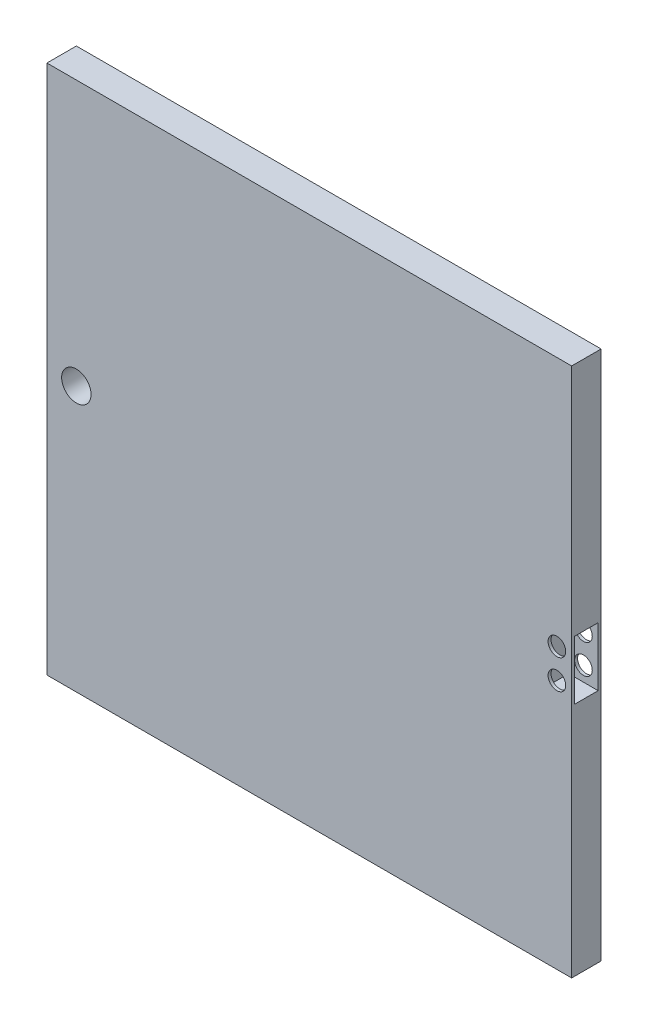
ISO-10303-21;
HEADER;
FILE_DESCRIPTION(('STEP AP214'),'2;1');
FILE_NAME('part.step','',(''),(''),'','','');
FILE_SCHEMA(('AUTOMOTIVE_DESIGN { 1 0 10303 214 1 1 1 1 }'));
ENDSEC;
DATA;
#1=APPLICATION_CONTEXT('core data for automotive mechanical design processes');
#2=APPLICATION_PROTOCOL_DEFINITION('international standard','automotive_design',2000,#1);
#3=PRODUCT_CONTEXT('',#1,'mechanical');
#4=PRODUCT('Part','Part','',(#3));
#5=PRODUCT_RELATED_PRODUCT_CATEGORY('part','',(#4));
#6=PRODUCT_DEFINITION_FORMATION('','',#4);
#7=PRODUCT_DEFINITION_CONTEXT('part definition',#1,'design');
#8=PRODUCT_DEFINITION('design','',#6,#7);
#9=PRODUCT_DEFINITION_SHAPE('','',#8);
#10=(LENGTH_UNIT() NAMED_UNIT(*) SI_UNIT(.MILLI.,.METRE.));
#11=(NAMED_UNIT(*) PLANE_ANGLE_UNIT() SI_UNIT($,.RADIAN.));
#12=(NAMED_UNIT(*) SI_UNIT($,.STERADIAN.) SOLID_ANGLE_UNIT());
#13=UNCERTAINTY_MEASURE_WITH_UNIT(LENGTH_MEASURE(1.E-05),#10,'distance_accuracy_value','');
#14=(GEOMETRIC_REPRESENTATION_CONTEXT(3) GLOBAL_UNCERTAINTY_ASSIGNED_CONTEXT((#13)) GLOBAL_UNIT_ASSIGNED_CONTEXT((#10,
#11,#12)) REPRESENTATION_CONTEXT('',''));
#15=CARTESIAN_POINT('',(0.,0.,0.));
#16=DIRECTION('',(0.,0.,1.));
#17=DIRECTION('',(1.,0.,0.));
#18=AXIS2_PLACEMENT_3D('',#15,#16,#17);
#19=CARTESIAN_POINT('',(-78.2272300469483,89.1981220657277,12.7));
#20=DIRECTION('',(1.,0.,0.));
#21=DIRECTION('',(0.,1.,0.));
#22=AXIS2_PLACEMENT_3D('',#19,#20,#21);
#23=PLANE('',#22);
#24=DIRECTION('',(0.,-1.,0.));
#25=VECTOR('',#24,1.);
#26=CARTESIAN_POINT('',(-78.2272300469483,89.1981220657277,0.));
#27=LINE('',#26,#25);
#28=CARTESIAN_POINT('',(-78.2272300469483,101.898122065728,0.));
#29=VERTEX_POINT('',#28);
#30=CARTESIAN_POINT('',(-78.2272300469483,-126.701877934272,0.));
#31=VERTEX_POINT('',#30);
#32=EDGE_CURVE('E87',#29,#31,#27,.T.);
#33=ORIENTED_EDGE('',*,*,#32,.T.);
#34=DIRECTION('',(0.,0.,-1.));
#35=VECTOR('',#34,1.);
#36=CARTESIAN_POINT('',(-78.2272300469483,-126.701877934272,12.7));
#37=LINE('',#36,#35);
#38=CARTESIAN_POINT('',(-78.2272300469483,-126.701877934272,12.7));
#39=VERTEX_POINT('',#38);
#40=EDGE_CURVE('E11',#39,#31,#37,.T.);
#41=ORIENTED_EDGE('',*,*,#40,.F.);
#42=DIRECTION('',(0.,-1.,0.));
#43=VECTOR('',#42,1.);
#44=CARTESIAN_POINT('',(-78.2272300469483,89.1981220657277,12.7));
#45=LINE('',#44,#43);
#46=CARTESIAN_POINT('',(-78.2272300469483,101.898122065728,12.7));
#47=VERTEX_POINT('',#46);
#48=EDGE_CURVE('E101',#47,#39,#45,.T.);
#49=ORIENTED_EDGE('',*,*,#48,.F.);
#50=DIRECTION('',(0.,0.,1.));
#51=VECTOR('',#50,1.);
#52=CARTESIAN_POINT('',(-78.2272300469483,101.898122065728,0.));
#53=LINE('',#52,#51);
#54=EDGE_CURVE('E176',#29,#47,#53,.T.);
#55=ORIENTED_EDGE('',*,*,#54,.F.);
#56=EDGE_LOOP('',(#33,#41,#49,#55));
#57=FACE_BOUND('',#56,.T.);
#58=ADVANCED_FACE('F41',(#57),#23,.F.);
#59=CARTESIAN_POINT('',(-78.2272300469483,-126.701877934272,12.7));
#60=DIRECTION('',(0.,1.,0.));
#61=DIRECTION('',(0.,0.,1.));
#62=AXIS2_PLACEMENT_3D('',#59,#60,#61);
#63=PLANE('',#62);
#64=DIRECTION('',(1.,0.,0.));
#65=VECTOR('',#64,1.);
#66=CARTESIAN_POINT('',(-78.2272300469483,-126.701877934272,0.));
#67=LINE('',#66,#65);
#68=CARTESIAN_POINT('',(148.086769953052,-126.701877934272,0.));
#69=VERTEX_POINT('',#68);
#70=EDGE_CURVE('E77',#31,#69,#67,.T.);
#71=ORIENTED_EDGE('',*,*,#70,.T.);
#72=DIRECTION('',(0.,0.,-1.));
#73=VECTOR('',#72,1.);
#74=CARTESIAN_POINT('',(148.086769953052,-126.701877934272,12.7));
#75=LINE('',#74,#73);
#76=CARTESIAN_POINT('',(148.086769953052,-126.701877934272,12.7));
#77=VERTEX_POINT('',#76);
#78=EDGE_CURVE('E49',#77,#69,#75,.T.);
#79=ORIENTED_EDGE('',*,*,#78,.F.);
#80=DIRECTION('',(1.,0.,0.));
#81=VECTOR('',#80,1.);
#82=CARTESIAN_POINT('',(-78.2272300469483,-126.701877934272,12.7));
#83=LINE('',#82,#81);
#84=EDGE_CURVE('E66',#39,#77,#83,.T.);
#85=ORIENTED_EDGE('',*,*,#84,.F.);
#86=ORIENTED_EDGE('',*,*,#40,.T.);
#87=EDGE_LOOP('',(#71,#79,#85,#86));
#88=FACE_BOUND('',#87,.T.);
#89=ADVANCED_FACE('F79',(#88),#63,.F.);
#90=CARTESIAN_POINT('',(148.086769953052,89.1981220657277,12.7));
#91=DIRECTION('',(-1.,0.,0.));
#92=DIRECTION('',(0.,-1.,0.));
#93=AXIS2_PLACEMENT_3D('',#90,#91,#92);
#94=PLANE('',#93);
#95=DIRECTION('',(0.,0.,-1.));
#96=VECTOR('',#95,1.);
#97=CARTESIAN_POINT('',(148.086769953052,-25.0939401241894,11.43));
#98=LINE('',#97,#96);
#99=CARTESIAN_POINT('',(148.086769953052,-25.0939401241894,11.43));
#100=VERTEX_POINT('',#99);
#101=CARTESIAN_POINT('',(148.086769953052,-25.0939401241894,1.26999999999999));
#102=VERTEX_POINT('',#101);
#103=EDGE_CURVE('E153',#100,#102,#98,.T.);
#104=ORIENTED_EDGE('',*,*,#103,.F.);
#105=DIRECTION('',(0.,-1.,0.));
#106=VECTOR('',#105,1.);
#107=CARTESIAN_POINT('',(148.086769953052,0.306059875810553,11.43));
#108=LINE('',#107,#106);
#109=CARTESIAN_POINT('',(148.086769953052,0.306059875810553,11.43));
#110=VERTEX_POINT('',#109);
#111=EDGE_CURVE('E57',#110,#100,#108,.T.);
#112=ORIENTED_EDGE('',*,*,#111,.F.);
#113=DIRECTION('',(0.,0.,1.));
#114=VECTOR('',#113,1.);
#115=CARTESIAN_POINT('',(148.086769953052,0.306059875810553,11.43));
#116=LINE('',#115,#114);
#117=CARTESIAN_POINT('',(148.086769953052,0.306059875810555,1.27));
#118=VERTEX_POINT('',#117);
#119=EDGE_CURVE('E142',#118,#110,#116,.T.);
#120=ORIENTED_EDGE('',*,*,#119,.F.);
#121=DIRECTION('',(0.,1.,0.));
#122=VECTOR('',#121,1.);
#123=CARTESIAN_POINT('',(148.086769953052,0.306059875810555,1.27));
#124=LINE('',#123,#122);
#125=EDGE_CURVE('E156',#102,#118,#124,.T.);
#126=ORIENTED_EDGE('',*,*,#125,.F.);
#127=EDGE_LOOP('',(#104,#112,#120,#126));
#128=FACE_BOUND('',#127,.T.);
#129=DIRECTION('',(0.,1.,0.));
#130=VECTOR('',#129,1.);
#131=CARTESIAN_POINT('',(148.086769953052,89.1981220657277,0.));
#132=LINE('',#131,#130);
#133=CARTESIAN_POINT('',(148.086769953052,101.898122065728,0.));
#134=VERTEX_POINT('',#133);
#135=EDGE_CURVE('E86',#69,#134,#132,.T.);
#136=ORIENTED_EDGE('',*,*,#135,.T.);
#137=DIRECTION('',(0.,0.,-1.));
#138=VECTOR('',#137,1.);
#139=CARTESIAN_POINT('',(148.086769953052,101.898122065728,0.));
#140=LINE('',#139,#138);
#141=CARTESIAN_POINT('',(148.086769953052,101.898122065728,12.7));
#142=VERTEX_POINT('',#141);
#143=EDGE_CURVE('E183',#142,#134,#140,.T.);
#144=ORIENTED_EDGE('',*,*,#143,.F.);
#145=DIRECTION('',(0.,1.,0.));
#146=VECTOR('',#145,1.);
#147=CARTESIAN_POINT('',(148.086769953052,89.1981220657277,12.7));
#148=LINE('',#147,#146);
#149=EDGE_CURVE('E95',#77,#142,#148,.T.);
#150=ORIENTED_EDGE('',*,*,#149,.F.);
#151=ORIENTED_EDGE('',*,*,#78,.T.);
#152=EDGE_LOOP('',(#136,#144,#150,#151));
#153=FACE_BOUND('',#152,.T.);
#154=ADVANCED_FACE('F91',(#128,#153),#94,.F.);
#155=CARTESIAN_POINT('',(0.,0.,12.7));
#156=DIRECTION('',(0.,0.,1.));
#157=DIRECTION('',(1.,0.,0.));
#158=AXIS2_PLACEMENT_3D('',#155,#156,#157);
#159=PLANE('',#158);
#160=CARTESIAN_POINT('',(-65.5272300469483,-12.4018779342723,12.7));
#161=DIRECTION('',(0.,0.,1.));
#162=DIRECTION('',(1.,0.,0.));
#163=AXIS2_PLACEMENT_3D('',#160,#161,#162);
#164=CIRCLE('',#163,6.35);
#165=CARTESIAN_POINT('',(-59.1772300469483,-12.4018779342723,12.7));
#166=VERTEX_POINT('',#165);
#167=EDGE_CURVE('E114',#166,#166,#164,.T.);
#168=ORIENTED_EDGE('',*,*,#167,.F.);
#169=EDGE_LOOP('',(#168));
#170=FACE_BOUND('',#169,.T.);
#171=CARTESIAN_POINT('',(141.736769953052,-6.04394012418949,12.7));
#172=DIRECTION('',(0.,0.,1.));
#173=DIRECTION('',(1.,0.,0.));
#174=AXIS2_PLACEMENT_3D('',#171,#172,#173);
#175=CIRCLE('',#174,3.81000000000001);
#176=CARTESIAN_POINT('',(145.546769953052,-6.04394012418949,12.7));
#177=VERTEX_POINT('',#176);
#178=EDGE_CURVE('E119',#177,#177,#175,.T.);
#179=ORIENTED_EDGE('',*,*,#178,.F.);
#180=EDGE_LOOP('',(#179));
#181=FACE_BOUND('',#180,.T.);
#182=CARTESIAN_POINT('',(141.736769953052,-18.7439401241895,12.7));
#183=DIRECTION('',(0.,0.,1.));
#184=DIRECTION('',(1.,0.,0.));
#185=AXIS2_PLACEMENT_3D('',#182,#183,#184);
#186=CIRCLE('',#185,3.81000000000001);
#187=CARTESIAN_POINT('',(145.546769953052,-18.7439401241895,12.7));
#188=VERTEX_POINT('',#187);
#189=EDGE_CURVE('E129',#188,#188,#186,.T.);
#190=ORIENTED_EDGE('',*,*,#189,.F.);
#191=EDGE_LOOP('',(#190));
#192=FACE_BOUND('',#191,.T.);
#193=ORIENTED_EDGE('',*,*,#48,.T.);
#194=ORIENTED_EDGE('',*,*,#84,.T.);
#195=ORIENTED_EDGE('',*,*,#149,.T.);
#196=DIRECTION('',(1.,0.,0.));
#197=VECTOR('',#196,1.);
#198=CARTESIAN_POINT('',(-78.2272300469483,101.898122065728,12.7));
#199=LINE('',#198,#197);
#200=EDGE_CURVE('E184',#47,#142,#199,.T.);
#201=ORIENTED_EDGE('',*,*,#200,.F.);
#202=EDGE_LOOP('',(#193,#194,#195,#201));
#203=FACE_BOUND('',#202,.T.);
#204=ADVANCED_FACE('F190',(#170,#181,#192,#203),#159,.T.);
#205=CARTESIAN_POINT('',(0.,0.,0.));
#206=DIRECTION('',(0.,0.,1.));
#207=DIRECTION('',(1.,0.,0.));
#208=AXIS2_PLACEMENT_3D('',#205,#206,#207);
#209=PLANE('',#208);
#210=CARTESIAN_POINT('',(-65.5272300469483,-12.4018779342723,0.));
#211=DIRECTION('',(0.,0.,1.));
#212=DIRECTION('',(1.,0.,0.));
#213=AXIS2_PLACEMENT_3D('',#210,#211,#212);
#214=CIRCLE('',#213,6.35);
#215=CARTESIAN_POINT('',(-59.1772300469483,-12.4018779342723,0.));
#216=VERTEX_POINT('',#215);
#217=EDGE_CURVE('E108',#216,#216,#214,.T.);
#218=ORIENTED_EDGE('',*,*,#217,.T.);
#219=EDGE_LOOP('',(#218));
#220=FACE_BOUND('',#219,.T.);
#221=CARTESIAN_POINT('',(141.736769953052,-6.04394012418949,0.));
#222=DIRECTION('',(0.,0.,1.));
#223=DIRECTION('',(1.,0.,0.));
#224=AXIS2_PLACEMENT_3D('',#221,#222,#223);
#225=CIRCLE('',#224,3.81000000000001);
#226=CARTESIAN_POINT('',(145.546769953052,-6.04394012418949,0.));
#227=VERTEX_POINT('',#226);
#228=EDGE_CURVE('E126',#227,#227,#225,.T.);
#229=ORIENTED_EDGE('',*,*,#228,.T.);
#230=EDGE_LOOP('',(#229));
#231=FACE_BOUND('',#230,.T.);
#232=CARTESIAN_POINT('',(141.736769953052,-18.7439401241895,0.));
#233=DIRECTION('',(0.,0.,1.));
#234=DIRECTION('',(1.,0.,0.));
#235=AXIS2_PLACEMENT_3D('',#232,#233,#234);
#236=CIRCLE('',#235,3.81000000000001);
#237=CARTESIAN_POINT('',(145.546769953052,-18.7439401241895,0.));
#238=VERTEX_POINT('',#237);
#239=EDGE_CURVE('E132',#238,#238,#236,.T.);
#240=ORIENTED_EDGE('',*,*,#239,.T.);
#241=EDGE_LOOP('',(#240));
#242=FACE_BOUND('',#241,.T.);
#243=ORIENTED_EDGE('',*,*,#32,.F.);
#244=DIRECTION('',(-1.,0.,0.));
#245=VECTOR('',#244,1.);
#246=CARTESIAN_POINT('',(-78.2272300469483,101.898122065728,0.));
#247=LINE('',#246,#245);
#248=EDGE_CURVE('E100',#134,#29,#247,.T.);
#249=ORIENTED_EDGE('',*,*,#248,.F.);
#250=ORIENTED_EDGE('',*,*,#135,.F.);
#251=ORIENTED_EDGE('',*,*,#70,.F.);
#252=EDGE_LOOP('',(#243,#249,#250,#251));
#253=FACE_BOUND('',#252,.T.);
#254=ADVANCED_FACE('F98',(#220,#231,#242,#253),#209,.F.);
#255=CARTESIAN_POINT('',(135.386769953052,0.306059875810553,11.43));
#256=DIRECTION('',(0.,0.,1.));
#257=DIRECTION('',(0.,-1.,0.));
#258=AXIS2_PLACEMENT_3D('',#255,#256,#257);
#259=PLANE('',#258);
#260=CARTESIAN_POINT('',(141.736769953052,-6.04394012418949,11.43));
#261=DIRECTION('',(0.,0.,1.));
#262=DIRECTION('',(0.,-1.,0.));
#263=AXIS2_PLACEMENT_3D('',#260,#261,#262);
#264=CIRCLE('',#263,3.81000000000001);
#265=CARTESIAN_POINT('',(141.736769953052,-9.8539401241895,11.43));
#266=VERTEX_POINT('',#265);
#267=EDGE_CURVE('E135',#266,#266,#264,.T.);
#268=ORIENTED_EDGE('',*,*,#267,.T.);
#269=EDGE_LOOP('',(#268));
#270=FACE_BOUND('',#269,.T.);
#271=CARTESIAN_POINT('',(141.736769953052,-18.7439401241895,11.43));
#272=DIRECTION('',(0.,0.,1.));
#273=DIRECTION('',(0.,-1.,0.));
#274=AXIS2_PLACEMENT_3D('',#271,#272,#273);
#275=CIRCLE('',#274,3.81000000000001);
#276=CARTESIAN_POINT('',(141.736769953052,-22.5539401241895,11.43));
#277=VERTEX_POINT('',#276);
#278=EDGE_CURVE('E107',#277,#277,#275,.T.);
#279=ORIENTED_EDGE('',*,*,#278,.T.);
#280=EDGE_LOOP('',(#279));
#281=FACE_BOUND('',#280,.T.);
#282=ORIENTED_EDGE('',*,*,#111,.T.);
#283=DIRECTION('',(1.,0.,0.));
#284=VECTOR('',#283,1.);
#285=CARTESIAN_POINT('',(135.386769953052,-25.0939401241894,11.43));
#286=LINE('',#285,#284);
#287=CARTESIAN_POINT('',(135.386769953052,-25.0939401241894,11.43));
#288=VERTEX_POINT('',#287);
#289=EDGE_CURVE('E151',#288,#100,#286,.T.);
#290=ORIENTED_EDGE('',*,*,#289,.F.);
#291=DIRECTION('',(0.,-1.,0.));
#292=VECTOR('',#291,1.);
#293=CARTESIAN_POINT('',(135.386769953052,0.306059875810553,11.43));
#294=LINE('',#293,#292);
#295=CARTESIAN_POINT('',(135.386769953052,0.306059875810553,11.43));
#296=VERTEX_POINT('',#295);
#297=EDGE_CURVE('E138',#296,#288,#294,.T.);
#298=ORIENTED_EDGE('',*,*,#297,.F.);
#299=DIRECTION('',(1.,0.,0.));
#300=VECTOR('',#299,1.);
#301=CARTESIAN_POINT('',(135.386769953052,0.306059875810553,11.43));
#302=LINE('',#301,#300);
#303=EDGE_CURVE('E161',#296,#110,#302,.T.);
#304=ORIENTED_EDGE('',*,*,#303,.T.);
#305=EDGE_LOOP('',(#282,#290,#298,#304));
#306=FACE_BOUND('',#305,.T.);
#307=ADVANCED_FACE('F208',(#270,#281,#306),#259,.F.);
#308=CARTESIAN_POINT('',(135.386769953052,0.306059875810553,11.43));
#309=DIRECTION('',(0.,1.,0.));
#310=DIRECTION('',(0.,0.,1.));
#311=AXIS2_PLACEMENT_3D('',#308,#309,#310);
#312=PLANE('',#311);
#313=ORIENTED_EDGE('',*,*,#119,.T.);
#314=ORIENTED_EDGE('',*,*,#303,.F.);
#315=DIRECTION('',(0.,0.,1.));
#316=VECTOR('',#315,1.);
#317=CARTESIAN_POINT('',(135.386769953052,0.306059875810553,11.43));
#318=LINE('',#317,#316);
#319=CARTESIAN_POINT('',(135.386769953052,0.306059875810555,1.27));
#320=VERTEX_POINT('',#319);
#321=EDGE_CURVE('E148',#320,#296,#318,.T.);
#322=ORIENTED_EDGE('',*,*,#321,.F.);
#323=DIRECTION('',(1.,0.,0.));
#324=VECTOR('',#323,1.);
#325=CARTESIAN_POINT('',(135.386769953052,0.306059875810555,1.27));
#326=LINE('',#325,#324);
#327=EDGE_CURVE('E163',#320,#118,#326,.T.);
#328=ORIENTED_EDGE('',*,*,#327,.T.);
#329=EDGE_LOOP('',(#313,#314,#322,#328));
#330=FACE_BOUND('',#329,.T.);
#331=ADVANCED_FACE('F212',(#330),#312,.F.);
#332=CARTESIAN_POINT('',(135.386769953052,0.306059875810555,1.27));
#333=DIRECTION('',(0.,0.,-1.));
#334=DIRECTION('',(0.,1.,0.));
#335=AXIS2_PLACEMENT_3D('',#332,#333,#334);
#336=PLANE('',#335);
#337=CARTESIAN_POINT('',(141.736769953052,-6.04394012418949,1.27));
#338=DIRECTION('',(0.,0.,-1.));
#339=DIRECTION('',(0.,1.,0.));
#340=AXIS2_PLACEMENT_3D('',#337,#338,#339);
#341=CIRCLE('',#340,3.81000000000001);
#342=CARTESIAN_POINT('',(141.736769953052,-2.23394012418948,1.27));
#343=VERTEX_POINT('',#342);
#344=EDGE_CURVE('E44',#343,#343,#341,.T.);
#345=ORIENTED_EDGE('',*,*,#344,.T.);
#346=EDGE_LOOP('',(#345));
#347=FACE_BOUND('',#346,.T.);
#348=CARTESIAN_POINT('',(141.736769953052,-18.7439401241895,1.26999999999999));
#349=DIRECTION('',(0.,0.,-1.));
#350=DIRECTION('',(0.,1.,0.));
#351=AXIS2_PLACEMENT_3D('',#348,#349,#350);
#352=CIRCLE('',#351,3.81000000000001);
#353=CARTESIAN_POINT('',(141.736769953052,-14.9339401241895,1.26999999999999));
#354=VERTEX_POINT('',#353);
#355=EDGE_CURVE('E105',#354,#354,#352,.T.);
#356=ORIENTED_EDGE('',*,*,#355,.T.);
#357=EDGE_LOOP('',(#356));
#358=FACE_BOUND('',#357,.T.);
#359=ORIENTED_EDGE('',*,*,#125,.T.);
#360=ORIENTED_EDGE('',*,*,#327,.F.);
#361=DIRECTION('',(0.,1.,0.));
#362=VECTOR('',#361,1.);
#363=CARTESIAN_POINT('',(135.386769953052,0.306059875810555,1.27));
#364=LINE('',#363,#362);
#365=CARTESIAN_POINT('',(135.386769953052,-25.0939401241894,1.26999999999999));
#366=VERTEX_POINT('',#365);
#367=EDGE_CURVE('E145',#366,#320,#364,.T.);
#368=ORIENTED_EDGE('',*,*,#367,.F.);
#369=DIRECTION('',(1.,0.,0.));
#370=VECTOR('',#369,1.);
#371=CARTESIAN_POINT('',(135.386769953052,-25.0939401241894,1.26999999999999));
#372=LINE('',#371,#370);
#373=EDGE_CURVE('E166',#366,#102,#372,.T.);
#374=ORIENTED_EDGE('',*,*,#373,.T.);
#375=EDGE_LOOP('',(#359,#360,#368,#374));
#376=FACE_BOUND('',#375,.T.);
#377=ADVANCED_FACE('F223',(#347,#358,#376),#336,.F.);
#378=CARTESIAN_POINT('',(135.386769953052,-25.0939401241894,11.43));
#379=DIRECTION('',(0.,-1.,0.));
#380=DIRECTION('',(0.,0.,-1.));
#381=AXIS2_PLACEMENT_3D('',#378,#379,#380);
#382=PLANE('',#381);
#383=ORIENTED_EDGE('',*,*,#103,.T.);
#384=ORIENTED_EDGE('',*,*,#373,.F.);
#385=DIRECTION('',(0.,0.,-1.));
#386=VECTOR('',#385,1.);
#387=CARTESIAN_POINT('',(135.386769953052,-25.0939401241894,11.43));
#388=LINE('',#387,#386);
#389=EDGE_CURVE('E141',#288,#366,#388,.T.);
#390=ORIENTED_EDGE('',*,*,#389,.F.);
#391=ORIENTED_EDGE('',*,*,#289,.T.);
#392=EDGE_LOOP('',(#383,#384,#390,#391));
#393=FACE_BOUND('',#392,.T.);
#394=ADVANCED_FACE('F217',(#393),#382,.F.);
#395=CARTESIAN_POINT('',(135.386769953052,0.,0.));
#396=DIRECTION('',(1.,0.,0.));
#397=DIRECTION('',(0.,0.,-1.));
#398=AXIS2_PLACEMENT_3D('',#395,#396,#397);
#399=PLANE('',#398);
#400=ORIENTED_EDGE('',*,*,#297,.T.);
#401=ORIENTED_EDGE('',*,*,#389,.T.);
#402=ORIENTED_EDGE('',*,*,#367,.T.);
#403=ORIENTED_EDGE('',*,*,#321,.T.);
#404=EDGE_LOOP('',(#400,#401,#402,#403));
#405=FACE_BOUND('',#404,.T.);
#406=ADVANCED_FACE('F221',(#405),#399,.T.);
#407=CARTESIAN_POINT('',(141.736769953052,-18.7439401241895,0.));
#408=DIRECTION('',(0.,0.,1.));
#409=DIRECTION('',(1.,0.,0.));
#410=AXIS2_PLACEMENT_3D('',#407,#408,#409);
#411=CYLINDRICAL_SURFACE('',#410,3.81000000000001);
#412=ORIENTED_EDGE('',*,*,#239,.F.);
#413=EDGE_LOOP('',(#412));
#414=FACE_BOUND('',#413,.T.);
#415=ORIENTED_EDGE('',*,*,#355,.F.);
#416=EDGE_LOOP('',(#415));
#417=FACE_BOUND('',#416,.T.);
#418=ADVANCED_FACE('F265',(#414,#417),#411,.F.);
#419=CARTESIAN_POINT('',(141.736769953052,-6.04394012418949,0.));
#420=DIRECTION('',(0.,0.,1.));
#421=DIRECTION('',(1.,0.,0.));
#422=AXIS2_PLACEMENT_3D('',#419,#420,#421);
#423=CYLINDRICAL_SURFACE('',#422,3.81000000000001);
#424=ORIENTED_EDGE('',*,*,#228,.F.);
#425=EDGE_LOOP('',(#424));
#426=FACE_BOUND('',#425,.T.);
#427=ORIENTED_EDGE('',*,*,#344,.F.);
#428=EDGE_LOOP('',(#427));
#429=FACE_BOUND('',#428,.T.);
#430=ADVANCED_FACE('F262',(#426,#429),#423,.F.);
#431=ORIENTED_EDGE('',*,*,#189,.T.);
#432=EDGE_LOOP('',(#431));
#433=FACE_BOUND('',#432,.T.);
#434=ORIENTED_EDGE('',*,*,#278,.F.);
#435=EDGE_LOOP('',(#434));
#436=FACE_BOUND('',#435,.T.);
#437=ADVANCED_FACE('F259',(#433,#436),#411,.F.);
#438=ORIENTED_EDGE('',*,*,#178,.T.);
#439=EDGE_LOOP('',(#438));
#440=FACE_BOUND('',#439,.T.);
#441=ORIENTED_EDGE('',*,*,#267,.F.);
#442=EDGE_LOOP('',(#441));
#443=FACE_BOUND('',#442,.T.);
#444=ADVANCED_FACE('F261',(#440,#443),#423,.F.);
#445=CARTESIAN_POINT('',(-65.5272300469483,-12.4018779342723,0.));
#446=DIRECTION('',(0.,0.,1.));
#447=DIRECTION('',(1.,0.,0.));
#448=AXIS2_PLACEMENT_3D('',#445,#446,#447);
#449=CYLINDRICAL_SURFACE('',#448,6.35);
#450=ORIENTED_EDGE('',*,*,#217,.F.);
#451=EDGE_LOOP('',(#450));
#452=FACE_BOUND('',#451,.T.);
#453=ORIENTED_EDGE('',*,*,#167,.T.);
#454=EDGE_LOOP('',(#453));
#455=FACE_BOUND('',#454,.T.);
#456=ADVANCED_FACE('F270',(#452,#455),#449,.F.);
#457=CARTESIAN_POINT('',(0.,101.898122065728,0.));
#458=DIRECTION('',(0.,1.,0.));
#459=DIRECTION('',(0.,0.,1.));
#460=AXIS2_PLACEMENT_3D('',#457,#458,#459);
#461=PLANE('',#460);
#462=ORIENTED_EDGE('',*,*,#54,.T.);
#463=ORIENTED_EDGE('',*,*,#200,.T.);
#464=ORIENTED_EDGE('',*,*,#143,.T.);
#465=ORIENTED_EDGE('',*,*,#248,.T.);
#466=EDGE_LOOP('',(#462,#463,#464,#465));
#467=FACE_BOUND('',#466,.T.);
#468=ADVANCED_FACE('F180',(#467),#461,.T.);
#469=CLOSED_SHELL('',(#58,#89,#154,#204,#254,#307,#331,#377,#394,#406,#418,#430,#437,#444,#456,#468));
#470=MANIFOLD_SOLID_BREP('B2',#469);
#471=ADVANCED_BREP_SHAPE_REPRESENTATION('',(#18,#470),#14);
#472=SHAPE_DEFINITION_REPRESENTATION(#9,#471);
ENDSEC;
END-ISO-10303-21;
